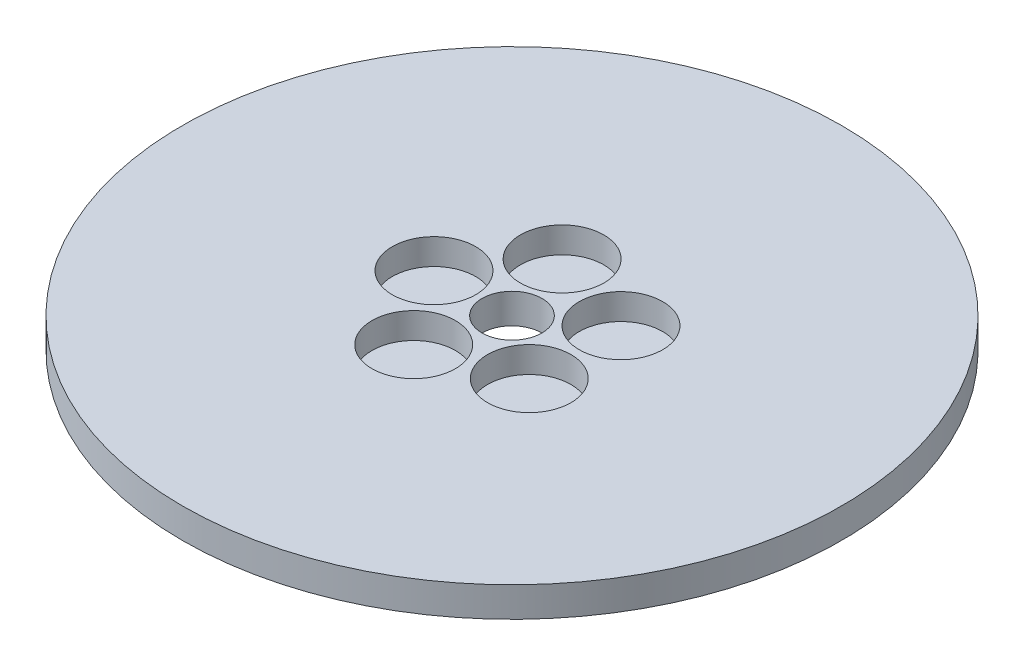
ISO-10303-21;
HEADER;
FILE_DESCRIPTION(('STEP AP214'),'2;1');
FILE_NAME('part.step','',(''),(''),'','','');
FILE_SCHEMA(('AUTOMOTIVE_DESIGN { 1 0 10303 214 1 1 1 1 }'));
ENDSEC;
DATA;
#1=APPLICATION_CONTEXT('core data for automotive mechanical design processes');
#2=APPLICATION_PROTOCOL_DEFINITION('international standard','automotive_design',2000,#1);
#3=PRODUCT_CONTEXT('',#1,'mechanical');
#4=PRODUCT('Part','Part','',(#3));
#5=PRODUCT_RELATED_PRODUCT_CATEGORY('part','',(#4));
#6=PRODUCT_DEFINITION_FORMATION('','',#4);
#7=PRODUCT_DEFINITION_CONTEXT('part definition',#1,'design');
#8=PRODUCT_DEFINITION('design','',#6,#7);
#9=PRODUCT_DEFINITION_SHAPE('','',#8);
#10=(LENGTH_UNIT() NAMED_UNIT(*) SI_UNIT(.MILLI.,.METRE.));
#11=(NAMED_UNIT(*) PLANE_ANGLE_UNIT() SI_UNIT($,.RADIAN.));
#12=(NAMED_UNIT(*) SI_UNIT($,.STERADIAN.) SOLID_ANGLE_UNIT());
#13=UNCERTAINTY_MEASURE_WITH_UNIT(LENGTH_MEASURE(1.E-05),#10,'distance_accuracy_value','');
#14=(GEOMETRIC_REPRESENTATION_CONTEXT(3) GLOBAL_UNCERTAINTY_ASSIGNED_CONTEXT((#13)) GLOBAL_UNIT_ASSIGNED_CONTEXT((#10,
#11,#12)) REPRESENTATION_CONTEXT('',''));
#15=CARTESIAN_POINT('',(0.,0.,0.));
#16=DIRECTION('',(0.,0.,1.));
#17=DIRECTION('',(1.,0.,0.));
#18=AXIS2_PLACEMENT_3D('',#15,#16,#17);
#19=CARTESIAN_POINT('',(0.,5.,0.));
#20=DIRECTION('',(0.,-1.,0.));
#21=DIRECTION('',(0.,0.,-1.));
#22=AXIS2_PLACEMENT_3D('',#19,#20,#21);
#23=CYLINDRICAL_SURFACE('',#22,55.);
#24=CARTESIAN_POINT('',(0.,5.,0.));
#25=DIRECTION('',(0.,1.,0.));
#26=DIRECTION('',(0.,0.,1.));
#27=AXIS2_PLACEMENT_3D('',#24,#25,#26);
#28=CIRCLE('',#27,55.);
#29=CARTESIAN_POINT('',(0.,5.,55.));
#30=VERTEX_POINT('',#29);
#31=EDGE_CURVE('E10',#30,#30,#28,.T.);
#32=ORIENTED_EDGE('',*,*,#31,.F.);
#33=EDGE_LOOP('',(#32));
#34=FACE_BOUND('',#33,.T.);
#35=CARTESIAN_POINT('',(0.,0.,0.));
#36=DIRECTION('',(0.,1.,0.));
#37=DIRECTION('',(0.,0.,1.));
#38=AXIS2_PLACEMENT_3D('',#35,#36,#37);
#39=CIRCLE('',#38,55.);
#40=CARTESIAN_POINT('',(0.,0.,55.));
#41=VERTEX_POINT('',#40);
#42=EDGE_CURVE('E37',#41,#41,#39,.T.);
#43=ORIENTED_EDGE('',*,*,#42,.T.);
#44=EDGE_LOOP('',(#43));
#45=FACE_BOUND('',#44,.T.);
#46=ADVANCED_FACE('F40',(#34,#45),#23,.T.);
#47=CARTESIAN_POINT('',(0.,5.,0.));
#48=DIRECTION('',(0.,1.,0.));
#49=DIRECTION('',(0.,0.,1.));
#50=AXIS2_PLACEMENT_3D('',#47,#48,#49);
#51=PLANE('',#50);
#52=CARTESIAN_POINT('',(-4.02309475091332,5.,-12.3818124833816));
#53=DIRECTION('',(0.,1.,0.));
#54=DIRECTION('',(-0.95105651629515,0.,0.309016994374958));
#55=AXIS2_PLACEMENT_3D('',#52,#53,#54);
#56=CIRCLE('',#55,6.96300708817405);
#57=CARTESIAN_POINT('',(-10.6453080151306,5.,-10.2301249611826));
#58=VERTEX_POINT('',#57);
#59=EDGE_CURVE('E70',#58,#58,#56,.T.);
#60=ORIENTED_EDGE('',*,*,#59,.F.);
#61=EDGE_LOOP('',(#60));
#62=FACE_BOUND('',#61,.T.);
#63=CARTESIAN_POINT('',(10.5325987978519,5.,-7.65238095705772));
#64=DIRECTION('',(0.,1.,0.));
#65=DIRECTION('',(-0.58778525229248,0.,-0.809016994374942));
#66=AXIS2_PLACEMENT_3D('',#63,#64,#65);
#67=CIRCLE('',#66,6.96300708817405);
#68=CARTESIAN_POINT('',(6.43984591981523,5.,-13.2855720233437));
#69=VERTEX_POINT('',#68);
#70=EDGE_CURVE('E71',#69,#69,#67,.T.);
#71=ORIENTED_EDGE('',*,*,#70,.F.);
#72=EDGE_LOOP('',(#71));
#73=FACE_BOUND('',#72,.T.);
#74=CARTESIAN_POINT('',(10.5325987978521,5.,7.65238095705756));
#75=DIRECTION('',(0.,1.,0.));
#76=DIRECTION('',(0.587785252292469,0.,-0.809016994374951));
#77=AXIS2_PLACEMENT_3D('',#74,#75,#76);
#78=CIRCLE('',#77,6.96300708817405);
#79=CARTESIAN_POINT('',(14.6253516758887,5.,2.01918989077151));
#80=VERTEX_POINT('',#79);
#81=EDGE_CURVE('E78',#80,#80,#78,.T.);
#82=ORIENTED_EDGE('',*,*,#81,.F.);
#83=EDGE_LOOP('',(#82));
#84=FACE_BOUND('',#83,.T.);
#85=CARTESIAN_POINT('',(-4.02309475091315,5.,12.3818124833817));
#86=DIRECTION('',(0.,1.,0.));
#87=DIRECTION('',(0.951056516295155,0.,0.309016994374945));
#88=AXIS2_PLACEMENT_3D('',#85,#86,#87);
#89=CIRCLE('',#88,6.96300708817405);
#90=CARTESIAN_POINT('',(2.59911851330413,5.,14.5335000055807));
#91=VERTEX_POINT('',#90);
#92=EDGE_CURVE('E61',#91,#91,#89,.T.);
#93=ORIENTED_EDGE('',*,*,#92,.F.);
#94=EDGE_LOOP('',(#93));
#95=FACE_BOUND('',#94,.T.);
#96=CARTESIAN_POINT('',(-13.0190080938776,5.,0.));
#97=DIRECTION('',(0.,1.,0.));
#98=DIRECTION('',(0.,0.,1.));
#99=AXIS2_PLACEMENT_3D('',#96,#97,#98);
#100=CIRCLE('',#99,6.96300708817405);
#101=CARTESIAN_POINT('',(-13.0190080938776,5.,6.96300708817405));
#102=VERTEX_POINT('',#101);
#103=EDGE_CURVE('E54',#102,#102,#100,.T.);
#104=ORIENTED_EDGE('',*,*,#103,.F.);
#105=EDGE_LOOP('',(#104));
#106=FACE_BOUND('',#105,.T.);
#107=CARTESIAN_POINT('',(0.,5.,0.));
#108=DIRECTION('',(0.,1.,0.));
#109=DIRECTION('',(0.,0.,1.));
#110=AXIS2_PLACEMENT_3D('',#107,#108,#109);
#111=CIRCLE('',#110,5.);
#112=CARTESIAN_POINT('',(0.,5.,5.));
#113=VERTEX_POINT('',#112);
#114=EDGE_CURVE('E50',#113,#113,#111,.T.);
#115=ORIENTED_EDGE('',*,*,#114,.F.);
#116=EDGE_LOOP('',(#115));
#117=FACE_BOUND('',#116,.T.);
#118=ORIENTED_EDGE('',*,*,#31,.T.);
#119=EDGE_LOOP('',(#118));
#120=FACE_BOUND('',#119,.T.);
#121=ADVANCED_FACE('F94',(#62,#73,#84,#95,#106,#117,#120),#51,.T.);
#122=CARTESIAN_POINT('',(0.,0.,0.));
#123=DIRECTION('',(0.,1.,0.));
#124=DIRECTION('',(0.,0.,1.));
#125=AXIS2_PLACEMENT_3D('',#122,#123,#124);
#126=PLANE('',#125);
#127=CARTESIAN_POINT('',(0.,0.,0.));
#128=DIRECTION('',(0.,1.,0.));
#129=DIRECTION('',(0.,0.,1.));
#130=AXIS2_PLACEMENT_3D('',#127,#128,#129);
#131=CIRCLE('',#130,5.);
#132=CARTESIAN_POINT('',(0.,0.,5.));
#133=VERTEX_POINT('',#132);
#134=EDGE_CURVE('E47',#133,#133,#131,.T.);
#135=ORIENTED_EDGE('',*,*,#134,.T.);
#136=EDGE_LOOP('',(#135));
#137=FACE_BOUND('',#136,.T.);
#138=ORIENTED_EDGE('',*,*,#42,.F.);
#139=EDGE_LOOP('',(#138));
#140=FACE_BOUND('',#139,.T.);
#141=ADVANCED_FACE('F100',(#137,#140),#126,.F.);
#142=CARTESIAN_POINT('',(0.,5.,0.));
#143=DIRECTION('',(0.,-1.,0.));
#144=DIRECTION('',(0.,0.,-1.));
#145=AXIS2_PLACEMENT_3D('',#142,#143,#144);
#146=CYLINDRICAL_SURFACE('',#145,5.);
#147=ORIENTED_EDGE('',*,*,#114,.T.);
#148=EDGE_LOOP('',(#147));
#149=FACE_BOUND('',#148,.T.);
#150=ORIENTED_EDGE('',*,*,#134,.F.);
#151=EDGE_LOOP('',(#150));
#152=FACE_BOUND('',#151,.T.);
#153=ADVANCED_FACE('F106',(#149,#152),#146,.F.);
#154=CARTESIAN_POINT('',(-13.0190080938776,0.67243995716299,0.));
#155=DIRECTION('',(0.,1.,0.));
#156=DIRECTION('',(0.,0.,1.));
#157=AXIS2_PLACEMENT_3D('',#154,#155,#156);
#158=CYLINDRICAL_SURFACE('',#157,6.96300708817405);
#159=CARTESIAN_POINT('',(-13.0190080938776,0.67243995716299,0.));
#160=DIRECTION('',(0.,1.,0.));
#161=DIRECTION('',(0.,0.,1.));
#162=AXIS2_PLACEMENT_3D('',#159,#160,#161);
#163=CIRCLE('',#162,6.96300708817405);
#164=CARTESIAN_POINT('',(-13.0190080938776,0.67243995716299,6.96300708817405));
#165=VERTEX_POINT('',#164);
#166=EDGE_CURVE('E55',#165,#165,#163,.T.);
#167=ORIENTED_EDGE('',*,*,#166,.F.);
#168=EDGE_LOOP('',(#167));
#169=FACE_BOUND('',#168,.T.);
#170=ORIENTED_EDGE('',*,*,#103,.T.);
#171=EDGE_LOOP('',(#170));
#172=FACE_BOUND('',#171,.T.);
#173=ADVANCED_FACE('F108',(#169,#172),#158,.F.);
#174=CARTESIAN_POINT('',(-13.0190080938776,0.67243995716299,0.));
#175=DIRECTION('',(0.,1.,0.));
#176=DIRECTION('',(0.,0.,1.));
#177=AXIS2_PLACEMENT_3D('',#174,#175,#176);
#178=PLANE('',#177);
#179=ORIENTED_EDGE('',*,*,#166,.T.);
#180=EDGE_LOOP('',(#179));
#181=FACE_BOUND('',#180,.T.);
#182=ADVANCED_FACE('F138',(#181),#178,.T.);
#183=CARTESIAN_POINT('',(-4.02309475091315,0.67243995716299,12.3818124833817));
#184=DIRECTION('',(0.,1.,0.));
#185=DIRECTION('',(0.,0.,1.));
#186=AXIS2_PLACEMENT_3D('',#183,#184,#185);
#187=CYLINDRICAL_SURFACE('',#186,6.96300708817405);
#188=CARTESIAN_POINT('',(-4.02309475091315,0.67243995716299,12.3818124833817));
#189=DIRECTION('',(0.,1.,0.));
#190=DIRECTION('',(0.951056516295155,0.,0.309016994374945));
#191=AXIS2_PLACEMENT_3D('',#188,#189,#190);
#192=CIRCLE('',#191,6.96300708817405);
#193=CARTESIAN_POINT('',(2.59911851330413,0.67243995716299,14.5335000055807));
#194=VERTEX_POINT('',#193);
#195=EDGE_CURVE('E59',#194,#194,#192,.T.);
#196=ORIENTED_EDGE('',*,*,#195,.F.);
#197=EDGE_LOOP('',(#196));
#198=FACE_BOUND('',#197,.T.);
#199=ORIENTED_EDGE('',*,*,#92,.T.);
#200=EDGE_LOOP('',(#199));
#201=FACE_BOUND('',#200,.T.);
#202=ADVANCED_FACE('F150',(#198,#201),#187,.F.);
#203=CARTESIAN_POINT('',(-4.02309475091315,0.67243995716299,12.3818124833817));
#204=DIRECTION('',(0.,1.,0.));
#205=DIRECTION('',(0.951056516295155,0.,0.309016994374945));
#206=AXIS2_PLACEMENT_3D('',#203,#204,#205);
#207=PLANE('',#206);
#208=ORIENTED_EDGE('',*,*,#195,.T.);
#209=EDGE_LOOP('',(#208));
#210=FACE_BOUND('',#209,.T.);
#211=ADVANCED_FACE('F89',(#210),#207,.T.);
#212=CARTESIAN_POINT('',(10.5325987978521,0.67243995716299,7.65238095705756));
#213=DIRECTION('',(0.,1.,0.));
#214=DIRECTION('',(0.,0.,1.));
#215=AXIS2_PLACEMENT_3D('',#212,#213,#214);
#216=CYLINDRICAL_SURFACE('',#215,6.96300708817405);
#217=CARTESIAN_POINT('',(10.5325987978521,0.67243995716299,7.65238095705756));
#218=DIRECTION('',(0.,1.,0.));
#219=DIRECTION('',(0.587785252292469,0.,-0.809016994374951));
#220=AXIS2_PLACEMENT_3D('',#217,#218,#219);
#221=CIRCLE('',#220,6.96300708817405);
#222=CARTESIAN_POINT('',(14.6253516758887,0.67243995716299,2.01918989077151));
#223=VERTEX_POINT('',#222);
#224=EDGE_CURVE('E63',#223,#223,#221,.T.);
#225=ORIENTED_EDGE('',*,*,#224,.F.);
#226=EDGE_LOOP('',(#225));
#227=FACE_BOUND('',#226,.T.);
#228=ORIENTED_EDGE('',*,*,#81,.T.);
#229=EDGE_LOOP('',(#228));
#230=FACE_BOUND('',#229,.T.);
#231=ADVANCED_FACE('F87',(#227,#230),#216,.F.);
#232=CARTESIAN_POINT('',(10.5325987978521,0.67243995716299,7.65238095705756));
#233=DIRECTION('',(0.,1.,0.));
#234=DIRECTION('',(0.587785252292469,0.,-0.809016994374951));
#235=AXIS2_PLACEMENT_3D('',#232,#233,#234);
#236=PLANE('',#235);
#237=ORIENTED_EDGE('',*,*,#224,.T.);
#238=EDGE_LOOP('',(#237));
#239=FACE_BOUND('',#238,.T.);
#240=ADVANCED_FACE('F84',(#239),#236,.T.);
#241=CARTESIAN_POINT('',(10.5325987978519,0.67243995716299,-7.65238095705772));
#242=DIRECTION('',(0.,1.,0.));
#243=DIRECTION('',(0.,0.,1.));
#244=AXIS2_PLACEMENT_3D('',#241,#242,#243);
#245=CYLINDRICAL_SURFACE('',#244,6.96300708817405);
#246=CARTESIAN_POINT('',(10.5325987978519,0.67243995716299,-7.65238095705772));
#247=DIRECTION('',(0.,1.,0.));
#248=DIRECTION('',(-0.58778525229248,0.,-0.809016994374942));
#249=AXIS2_PLACEMENT_3D('',#246,#247,#248);
#250=CIRCLE('',#249,6.96300708817405);
#251=CARTESIAN_POINT('',(6.43984591981523,0.67243995716299,-13.2855720233437));
#252=VERTEX_POINT('',#251);
#253=EDGE_CURVE('E76',#252,#252,#250,.T.);
#254=ORIENTED_EDGE('',*,*,#253,.F.);
#255=EDGE_LOOP('',(#254));
#256=FACE_BOUND('',#255,.T.);
#257=ORIENTED_EDGE('',*,*,#70,.T.);
#258=EDGE_LOOP('',(#257));
#259=FACE_BOUND('',#258,.T.);
#260=ADVANCED_FACE('F185',(#256,#259),#245,.F.);
#261=CARTESIAN_POINT('',(10.5325987978519,0.67243995716299,-7.65238095705772));
#262=DIRECTION('',(0.,1.,0.));
#263=DIRECTION('',(-0.58778525229248,0.,-0.809016994374942));
#264=AXIS2_PLACEMENT_3D('',#261,#262,#263);
#265=PLANE('',#264);
#266=ORIENTED_EDGE('',*,*,#253,.T.);
#267=EDGE_LOOP('',(#266));
#268=FACE_BOUND('',#267,.T.);
#269=ADVANCED_FACE('F189',(#268),#265,.T.);
#270=CARTESIAN_POINT('',(-4.02309475091332,0.67243995716299,-12.3818124833816));
#271=DIRECTION('',(0.,1.,0.));
#272=DIRECTION('',(0.,0.,1.));
#273=AXIS2_PLACEMENT_3D('',#270,#271,#272);
#274=CYLINDRICAL_SURFACE('',#273,6.96300708817405);
#275=CARTESIAN_POINT('',(-4.02309475091332,0.67243995716299,-12.3818124833816));
#276=DIRECTION('',(0.,1.,0.));
#277=DIRECTION('',(-0.95105651629515,0.,0.309016994374958));
#278=AXIS2_PLACEMENT_3D('',#275,#276,#277);
#279=CIRCLE('',#278,6.96300708817405);
#280=CARTESIAN_POINT('',(-10.6453080151306,0.67243995716299,-10.2301249611826));
#281=VERTEX_POINT('',#280);
#282=EDGE_CURVE('E69',#281,#281,#279,.T.);
#283=ORIENTED_EDGE('',*,*,#282,.F.);
#284=EDGE_LOOP('',(#283));
#285=FACE_BOUND('',#284,.T.);
#286=ORIENTED_EDGE('',*,*,#59,.T.);
#287=EDGE_LOOP('',(#286));
#288=FACE_BOUND('',#287,.T.);
#289=ADVANCED_FACE('F200',(#285,#288),#274,.F.);
#290=CARTESIAN_POINT('',(-4.02309475091332,0.67243995716299,-12.3818124833816));
#291=DIRECTION('',(0.,1.,0.));
#292=DIRECTION('',(-0.95105651629515,0.,0.309016994374958));
#293=AXIS2_PLACEMENT_3D('',#290,#291,#292);
#294=PLANE('',#293);
#295=ORIENTED_EDGE('',*,*,#282,.T.);
#296=EDGE_LOOP('',(#295));
#297=FACE_BOUND('',#296,.T.);
#298=ADVANCED_FACE('F208',(#297),#294,.T.);
#299=CLOSED_SHELL('',(#46,#121,#141,#153,#173,#182,#202,#211,#231,#240,#260,#269,#289,#298));
#300=MANIFOLD_SOLID_BREP('B2',#299);
#301=ADVANCED_BREP_SHAPE_REPRESENTATION('',(#18,#300),#14);
#302=SHAPE_DEFINITION_REPRESENTATION(#9,#301);
ENDSEC;
END-ISO-10303-21;
